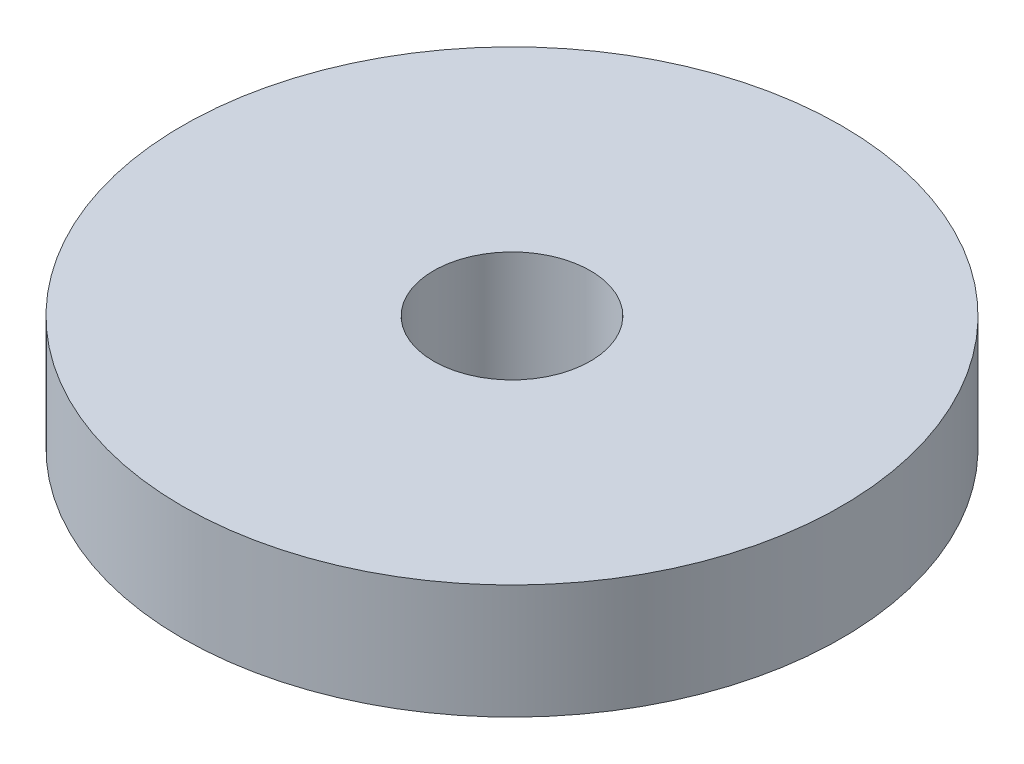
ISO-10303-21;
HEADER;
FILE_DESCRIPTION(('STEP AP214'),'2;1');
FILE_NAME('part.step','',(''),(''),'','','');
FILE_SCHEMA(('AUTOMOTIVE_DESIGN { 1 0 10303 214 1 1 1 1 }'));
ENDSEC;
DATA;
#1=APPLICATION_CONTEXT('core data for automotive mechanical design processes');
#2=APPLICATION_PROTOCOL_DEFINITION('international standard','automotive_design',2000,#1);
#3=PRODUCT_CONTEXT('',#1,'mechanical');
#4=PRODUCT('Part','Part','',(#3));
#5=PRODUCT_RELATED_PRODUCT_CATEGORY('part','',(#4));
#6=PRODUCT_DEFINITION_FORMATION('','',#4);
#7=PRODUCT_DEFINITION_CONTEXT('part definition',#1,'design');
#8=PRODUCT_DEFINITION('design','',#6,#7);
#9=PRODUCT_DEFINITION_SHAPE('','',#8);
#10=(LENGTH_UNIT() NAMED_UNIT(*) SI_UNIT(.MILLI.,.METRE.));
#11=(NAMED_UNIT(*) PLANE_ANGLE_UNIT() SI_UNIT($,.RADIAN.));
#12=(NAMED_UNIT(*) SI_UNIT($,.STERADIAN.) SOLID_ANGLE_UNIT());
#13=UNCERTAINTY_MEASURE_WITH_UNIT(LENGTH_MEASURE(1.E-05),#10,'distance_accuracy_value','');
#14=(GEOMETRIC_REPRESENTATION_CONTEXT(3) GLOBAL_UNCERTAINTY_ASSIGNED_CONTEXT((#13)) GLOBAL_UNIT_ASSIGNED_CONTEXT((#10,
#11,#12)) REPRESENTATION_CONTEXT('',''));
#15=CARTESIAN_POINT('',(0.,0.,0.));
#16=DIRECTION('',(0.,0.,1.));
#17=DIRECTION('',(1.,0.,0.));
#18=AXIS2_PLACEMENT_3D('',#15,#16,#17);
#19=CARTESIAN_POINT('',(0.,4.7625,0.));
#20=DIRECTION('',(0.,1.,0.));
#21=DIRECTION('',(0.,0.,1.));
#22=AXIS2_PLACEMENT_3D('',#19,#20,#21);
#23=PLANE('',#22);
#24=CARTESIAN_POINT('',(0.,4.7625,0.));
#25=DIRECTION('',(0.,1.,0.));
#26=DIRECTION('',(0.,0.,1.));
#27=AXIS2_PLACEMENT_3D('',#24,#25,#26);
#28=CIRCLE('',#27,13.716);
#29=CARTESIAN_POINT('',(0.,4.7625,13.716));
#30=VERTEX_POINT('',#29);
#31=EDGE_CURVE('E10',#30,#30,#28,.T.);
#32=ORIENTED_EDGE('',*,*,#31,.T.);
#33=EDGE_LOOP('',(#32));
#34=FACE_BOUND('',#33,.T.);
#35=CARTESIAN_POINT('',(0.,4.7625,0.));
#36=DIRECTION('',(0.,1.,0.));
#37=DIRECTION('',(0.,0.,1.));
#38=AXIS2_PLACEMENT_3D('',#35,#36,#37);
#39=CIRCLE('',#38,3.2639);
#40=CARTESIAN_POINT('',(0.,4.7625,3.2639));
#41=VERTEX_POINT('',#40);
#42=EDGE_CURVE('E48',#41,#41,#39,.T.);
#43=ORIENTED_EDGE('',*,*,#42,.F.);
#44=EDGE_LOOP('',(#43));
#45=FACE_BOUND('',#44,.T.);
#46=ADVANCED_FACE('F37',(#34,#45),#23,.T.);
#47=CARTESIAN_POINT('',(0.,0.,0.));
#48=DIRECTION('',(0.,1.,0.));
#49=DIRECTION('',(0.,0.,1.));
#50=AXIS2_PLACEMENT_3D('',#47,#48,#49);
#51=PLANE('',#50);
#52=CARTESIAN_POINT('',(0.,0.,0.));
#53=DIRECTION('',(0.,1.,0.));
#54=DIRECTION('',(0.,0.,1.));
#55=AXIS2_PLACEMENT_3D('',#52,#53,#54);
#56=CIRCLE('',#55,13.716);
#57=CARTESIAN_POINT('',(0.,0.,13.716));
#58=VERTEX_POINT('',#57);
#59=EDGE_CURVE('E41',#58,#58,#56,.T.);
#60=ORIENTED_EDGE('',*,*,#59,.F.);
#61=EDGE_LOOP('',(#60));
#62=FACE_BOUND('',#61,.T.);
#63=CARTESIAN_POINT('',(0.,0.,0.));
#64=DIRECTION('',(0.,1.,0.));
#65=DIRECTION('',(0.,0.,1.));
#66=AXIS2_PLACEMENT_3D('',#63,#64,#65);
#67=CIRCLE('',#66,3.2639);
#68=CARTESIAN_POINT('',(0.,0.,3.2639));
#69=VERTEX_POINT('',#68);
#70=EDGE_CURVE('E50',#69,#69,#67,.T.);
#71=ORIENTED_EDGE('',*,*,#70,.T.);
#72=EDGE_LOOP('',(#71));
#73=FACE_BOUND('',#72,.T.);
#74=ADVANCED_FACE('F60',(#62,#73),#51,.F.);
#75=CARTESIAN_POINT('',(0.,4.7625,0.));
#76=DIRECTION('',(0.,-1.,0.));
#77=DIRECTION('',(0.,0.,-1.));
#78=AXIS2_PLACEMENT_3D('',#75,#76,#77);
#79=CYLINDRICAL_SURFACE('',#78,13.716);
#80=ORIENTED_EDGE('',*,*,#31,.F.);
#81=EDGE_LOOP('',(#80));
#82=FACE_BOUND('',#81,.T.);
#83=ORIENTED_EDGE('',*,*,#59,.T.);
#84=EDGE_LOOP('',(#83));
#85=FACE_BOUND('',#84,.T.);
#86=ADVANCED_FACE('F39',(#82,#85),#79,.T.);
#87=CARTESIAN_POINT('',(0.,4.7625,0.));
#88=DIRECTION('',(0.,-1.,0.));
#89=DIRECTION('',(0.,0.,-1.));
#90=AXIS2_PLACEMENT_3D('',#87,#88,#89);
#91=CYLINDRICAL_SURFACE('',#90,3.2639);
#92=ORIENTED_EDGE('',*,*,#42,.T.);
#93=EDGE_LOOP('',(#92));
#94=FACE_BOUND('',#93,.T.);
#95=ORIENTED_EDGE('',*,*,#70,.F.);
#96=EDGE_LOOP('',(#95));
#97=FACE_BOUND('',#96,.T.);
#98=ADVANCED_FACE('F56',(#94,#97),#91,.F.);
#99=CLOSED_SHELL('',(#46,#74,#86,#98));
#100=MANIFOLD_SOLID_BREP('B2',#99);
#101=ADVANCED_BREP_SHAPE_REPRESENTATION('',(#18,#100),#14);
#102=SHAPE_DEFINITION_REPRESENTATION(#9,#101);
ENDSEC;
END-ISO-10303-21;
